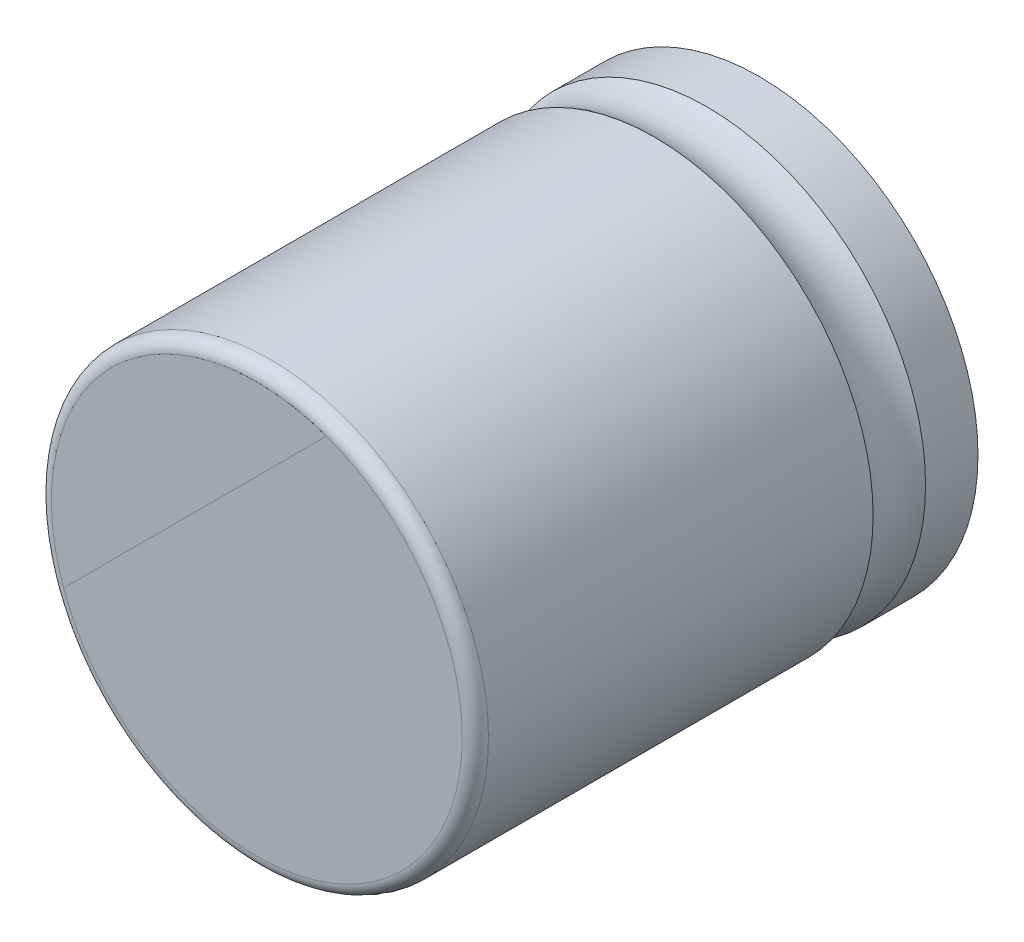
ISO-10303-21;
HEADER;
FILE_DESCRIPTION(('STEP AP214'),'2;1');
FILE_NAME('part.step','',(''),(''),'','','');
FILE_SCHEMA(('AUTOMOTIVE_DESIGN { 1 0 10303 214 1 1 1 1 }'));
ENDSEC;
DATA;
#1=APPLICATION_CONTEXT('core data for automotive mechanical design processes');
#2=APPLICATION_PROTOCOL_DEFINITION('international standard','automotive_design',2000,#1);
#3=PRODUCT_CONTEXT('',#1,'mechanical');
#4=PRODUCT('Part','Part','',(#3));
#5=PRODUCT_RELATED_PRODUCT_CATEGORY('part','',(#4));
#6=PRODUCT_DEFINITION_FORMATION('','',#4);
#7=PRODUCT_DEFINITION_CONTEXT('part definition',#1,'design');
#8=PRODUCT_DEFINITION('design','',#6,#7);
#9=PRODUCT_DEFINITION_SHAPE('','',#8);
#10=(LENGTH_UNIT() NAMED_UNIT(*) SI_UNIT(.MILLI.,.METRE.));
#11=(NAMED_UNIT(*) PLANE_ANGLE_UNIT() SI_UNIT($,.RADIAN.));
#12=(NAMED_UNIT(*) SI_UNIT($,.STERADIAN.) SOLID_ANGLE_UNIT());
#13=UNCERTAINTY_MEASURE_WITH_UNIT(LENGTH_MEASURE(1.E-05),#10,'distance_accuracy_value','');
#14=(GEOMETRIC_REPRESENTATION_CONTEXT(3) GLOBAL_UNCERTAINTY_ASSIGNED_CONTEXT((#13)) GLOBAL_UNIT_ASSIGNED_CONTEXT((#10,
#11,#12)) REPRESENTATION_CONTEXT('',''));
#15=CARTESIAN_POINT('',(0.,0.,0.));
#16=DIRECTION('',(0.,0.,1.));
#17=DIRECTION('',(1.,0.,0.));
#18=AXIS2_PLACEMENT_3D('',#15,#16,#17);
#19=CARTESIAN_POINT('',(-24.577797863612,-10.8690262039125,3.050316059209));
#20=DIRECTION('',(-3.09086346086632E-08,-3.09086341954809E-08,-1.));
#21=DIRECTION('',(-0.707106781186547,-0.707106781186547,4.37114099658419E-08));
#22=AXIS2_PLACEMENT_3D('',#19,#20,#21);
#23=PLANE('',#22);
#24=CARTESIAN_POINT('',(-24.577797863612,-10.8690262039125,3.050316059209));
#25=DIRECTION('',(-3.09086346086632E-08,-3.09086341954809E-08,-1.));
#26=DIRECTION('',(-0.707106781186548,0.707106781186548,0.));
#27=AXIS2_PLACEMENT_3D('',#24,#25,#26);
#28=CIRCLE('',#27,5.);
#29=CARTESIAN_POINT('',(-28.1133317695447,-7.33349229797976,3.050316059209));
#30=VERTEX_POINT('',#29);
#31=EDGE_CURVE('E11',#30,#30,#28,.T.);
#32=ORIENTED_EDGE('',*,*,#31,.T.);
#33=EDGE_LOOP('',(#32));
#34=FACE_BOUND('',#33,.T.);
#35=ADVANCED_FACE('F17',(#34),#23,.T.);
#36=CARTESIAN_POINT('',(-24.5777976797056,-10.8690260200061,9.000316059209));
#37=DIRECTION('',(-3.09086346086632E-08,-3.09086341954809E-08,-1.));
#38=DIRECTION('',(-0.707106781186548,0.707106781186548,0.));
#39=AXIS2_PLACEMENT_3D('',#36,#37,#38);
#40=CYLINDRICAL_SURFACE('',#39,5.);
#41=ORIENTED_EDGE('',*,*,#31,.F.);
#42=EDGE_LOOP('',(#41));
#43=FACE_BOUND('',#42,.T.);
#44=CARTESIAN_POINT('',(-24.5777978265216,-10.8690261668221,4.25031605920913));
#45=DIRECTION('',(-3.09086346086632E-08,-3.09086341954809E-08,-1.));
#46=DIRECTION('',(0.707106781186548,-0.707106781186548,0.));
#47=AXIS2_PLACEMENT_3D('',#44,#45,#46);
#48=CIRCLE('',#47,5.);
#49=CARTESIAN_POINT('',(-21.0422639205889,-14.4045600727549,4.25031605920912));
#50=VERTEX_POINT('',#49);
#51=EDGE_CURVE('E27',#50,#50,#48,.T.);
#52=ORIENTED_EDGE('',*,*,#51,.T.);
#53=EDGE_LOOP('',(#52));
#54=FACE_BOUND('',#53,.T.);
#55=ADVANCED_FACE('F107',(#43,#54),#40,.T.);
#56=CARTESIAN_POINT('',(-24.5777978079764,-10.869026148277,4.850316059209));
#57=DIRECTION('',(-3.09086346086632E-08,-3.09086341954809E-08,-1.));
#58=DIRECTION('',(-0.707106781186547,-0.707106781186547,4.37114099658419E-08));
#59=AXIS2_PLACEMENT_3D('',#56,#57,#58);
#60=TOROIDAL_SURFACE('',#59,5.941071428571,1.116071428571);
#61=CARTESIAN_POINT('',(-24.5777977894313,-10.8690261297318,5.450316059209));
#62=DIRECTION('',(-3.09086346086632E-08,-3.09086341954809E-08,-1.));
#63=DIRECTION('',(-0.707106781186548,0.707106781186548,0.));
#64=AXIS2_PLACEMENT_3D('',#61,#62,#63);
#65=CIRCLE('',#64,5.);
#66=CARTESIAN_POINT('',(-28.113331695364,-7.33349222379906,5.450316059209));
#67=VERTEX_POINT('',#66);
#68=EDGE_CURVE('E84',#67,#67,#65,.T.);
#69=ORIENTED_EDGE('',*,*,#68,.T.);
#70=EDGE_LOOP('',(#69));
#71=FACE_BOUND('',#70,.T.);
#72=ORIENTED_EDGE('',*,*,#51,.F.);
#73=EDGE_LOOP('',(#72));
#74=FACE_BOUND('',#73,.T.);
#75=ADVANCED_FACE('F113',(#71,#74),#60,.F.);
#76=ORIENTED_EDGE('',*,*,#68,.F.);
#77=EDGE_LOOP('',(#76));
#78=FACE_BOUND('',#77,.T.);
#79=CARTESIAN_POINT('',(-24.5777975174353,-10.8690258577358,14.250316059209));
#80=DIRECTION('',(3.09086345995963E-08,3.09086342045479E-08,1.));
#81=DIRECTION('',(1.,0.,-3.09086345995963E-08));
#82=AXIS2_PLACEMENT_3D('',#79,#80,#81);
#83=CIRCLE('',#82,5.);
#84=CARTESIAN_POINT('',(-19.5777975174353,-10.8690258577358,14.2503159046658));
#85=VERTEX_POINT('',#84);
#86=EDGE_CURVE('E61',#85,#85,#83,.T.);
#87=ORIENTED_EDGE('',*,*,#86,.F.);
#88=EDGE_LOOP('',(#87));
#89=FACE_BOUND('',#88,.T.);
#90=ADVANCED_FACE('F116',(#78,#89),#40,.T.);
#91=CARTESIAN_POINT('',(-24.5777975174353,-10.8690258577358,14.250316059209));
#92=DIRECTION('',(3.09086345995963E-08,3.09086342045479E-08,1.));
#93=DIRECTION('',(1.,0.,-3.09086345995963E-08));
#94=AXIS2_PLACEMENT_3D('',#91,#92,#93);
#95=TOROIDAL_SURFACE('',#94,4.7,0.3);
#96=ORIENTED_EDGE('',*,*,#86,.T.);
#97=EDGE_LOOP('',(#96));
#98=FACE_BOUND('',#97,.T.);
#99=CARTESIAN_POINT('',(-24.5777975081627,-10.8690258484632,14.550316059209));
#100=DIRECTION('',(-3.09086345995963E-08,-3.09086342045479E-08,-1.));
#101=DIRECTION('',(-1.,0.,3.09086345995963E-08));
#102=AXIS2_PLACEMENT_3D('',#99,#100,#101);
#103=CIRCLE('',#102,4.7);
#104=CARTESIAN_POINT('',(-28.9995017189001,-12.4623029344551,14.5503162451238));
#105=VERTEX_POINT('',#104);
#106=CARTESIAN_POINT('',(-22.9845204221714,-6.44732163772573,14.5503158732941));
#107=VERTEX_POINT('',#106);
#108=EDGE_CURVE('E57',#105,#107,#103,.T.);
#109=ORIENTED_EDGE('',*,*,#108,.T.);
#110=CARTESIAN_POINT('',(-24.5777975081627,-10.8690258484632,14.550316059209));
#111=DIRECTION('',(3.09086345995963E-08,3.09086342045479E-08,1.));
#112=DIRECTION('',(1.,0.,-3.09086345995963E-08));
#113=AXIS2_PLACEMENT_3D('',#110,#111,#112);
#114=CIRCLE('',#113,4.7);
#115=EDGE_CURVE('E54',#107,#105,#114,.F.);
#116=ORIENTED_EDGE('',*,*,#115,.T.);
#117=EDGE_LOOP('',(#109,#116));
#118=FACE_BOUND('',#117,.T.);
#119=ADVANCED_FACE('F19',(#98,#118),#95,.T.);
#120=CARTESIAN_POINT('',(-26.5941343217109,-8.85268903491502,14.550316059209));
#121=DIRECTION('',(3.09086345995963E-08,3.09086342045479E-08,1.));
#122=DIRECTION('',(0.707106781186547,0.707106781186547,-4.37114099658419E-08));
#123=AXIS2_PLACEMENT_3D('',#120,#121,#122);
#124=PLANE('',#123);
#125=DIRECTION('',(-0.707106781186547,-0.707106781186547,4.37114099658419E-08));
#126=VECTOR('',#125,1.);
#127=CARTESIAN_POINT('',(-28.9995017189001,-12.4623029344544,14.5503162451238));
#128=LINE('',#127,#126);
#129=EDGE_CURVE('E63',#107,#105,#128,.T.);
#130=ORIENTED_EDGE('',*,*,#129,.T.);
#131=ORIENTED_EDGE('',*,*,#115,.F.);
#132=EDGE_LOOP('',(#130,#131));
#133=FACE_BOUND('',#132,.T.);
#134=ADVANCED_FACE('F64',(#133),#124,.T.);
#135=CARTESIAN_POINT('',(-26.59413432168,-8.85268903488411,14.551316059209));
#136=DIRECTION('',(3.09086345995963E-08,3.09086342045479E-08,1.));
#137=DIRECTION('',(0.707106781186547,0.707106781186547,-4.37114099658419E-08));
#138=AXIS2_PLACEMENT_3D('',#135,#136,#137);
#139=PLANE('',#138);
#140=DIRECTION('',(0.707106781186547,0.707106781186547,-4.37114099658419E-08));
#141=VECTOR('',#140,1.);
#142=CARTESIAN_POINT('',(-25.9920110705049,-9.4548122860592,14.551316059209));
#143=LINE('',#142,#141);
#144=CARTESIAN_POINT('',(-28.9995017188691,-12.4623029344235,14.5513162451238));
#145=VERTEX_POINT('',#144);
#146=CARTESIAN_POINT('',(-22.9845204221407,-6.44732163769495,14.5513158732941));
#147=VERTEX_POINT('',#146);
#148=EDGE_CURVE('E38',#145,#147,#143,.T.);
#149=ORIENTED_EDGE('',*,*,#148,.T.);
#150=CARTESIAN_POINT('',(-24.5777975081318,-10.8690258484323,14.551316059209));
#151=DIRECTION('',(3.09086345995963E-08,3.09086342045479E-08,1.));
#152=DIRECTION('',(1.,0.,-3.09086345995963E-08));
#153=AXIS2_PLACEMENT_3D('',#150,#151,#152);
#154=CIRCLE('',#153,4.7);
#155=EDGE_CURVE('E21',#147,#145,#154,.T.);
#156=ORIENTED_EDGE('',*,*,#155,.T.);
#157=EDGE_LOOP('',(#149,#156));
#158=FACE_BOUND('',#157,.T.);
#159=ADVANCED_FACE('F97',(#158),#139,.T.);
#160=CARTESIAN_POINT('',(-28.9995017807173,-12.4623029962716,12.5503162451239));
#161=DIRECTION('',(0.707106781186548,-0.707106781186548,0.));
#162=DIRECTION('',(0.707106781186547,0.707106781186547,-4.37114099658419E-08));
#163=AXIS2_PLACEMENT_3D('',#160,#161,#162);
#164=PLANE('',#163);
#165=ORIENTED_EDGE('',*,*,#129,.F.);
#166=DIRECTION('',(3.09086344020721E-08,3.09086344020721E-08,1.));
#167=VECTOR('',#166,1.);
#168=CARTESIAN_POINT('',(-22.9845204839888,-6.44732169954312,12.5503158732941));
#169=LINE('',#168,#167);
#170=EDGE_CURVE('E67',#107,#147,#169,.T.);
#171=ORIENTED_EDGE('',*,*,#170,.T.);
#172=ORIENTED_EDGE('',*,*,#148,.F.);
#173=DIRECTION('',(3.09086344020721E-08,3.09086344020721E-08,1.));
#174=VECTOR('',#173,1.);
#175=CARTESIAN_POINT('',(-28.9995017807173,-12.4623029962716,12.5503162451239));
#176=LINE('',#175,#174);
#177=EDGE_CURVE('E70',#105,#145,#176,.T.);
#178=ORIENTED_EDGE('',*,*,#177,.F.);
#179=EDGE_LOOP('',(#165,#171,#172,#178));
#180=FACE_BOUND('',#179,.T.);
#181=ADVANCED_FACE('F71',(#180),#164,.T.);
#182=CARTESIAN_POINT('',(-24.5777975699799,-10.8690259102805,12.550316059209));
#183=DIRECTION('',(3.09086344020721E-08,3.09086344020721E-08,1.));
#184=DIRECTION('',(-0.707106781186548,0.707106781186548,0.));
#185=AXIS2_PLACEMENT_3D('',#182,#183,#184);
#186=CYLINDRICAL_SURFACE('',#185,4.7);
#187=ORIENTED_EDGE('',*,*,#108,.F.);
#188=ORIENTED_EDGE('',*,*,#177,.T.);
#189=ORIENTED_EDGE('',*,*,#155,.F.);
#190=ORIENTED_EDGE('',*,*,#170,.F.);
#191=EDGE_LOOP('',(#187,#188,#189,#190));
#192=FACE_BOUND('',#191,.T.);
#193=ADVANCED_FACE('F76',(#192),#186,.T.);
#194=CLOSED_SHELL('',(#35,#55,#75,#90,#119,#134,#159,#181,#193));
#195=MANIFOLD_SOLID_BREP('B1',#194);
#196=ADVANCED_BREP_SHAPE_REPRESENTATION('',(#18,#195),#14);
#197=SHAPE_DEFINITION_REPRESENTATION(#9,#196);
ENDSEC;
END-ISO-10303-21;
